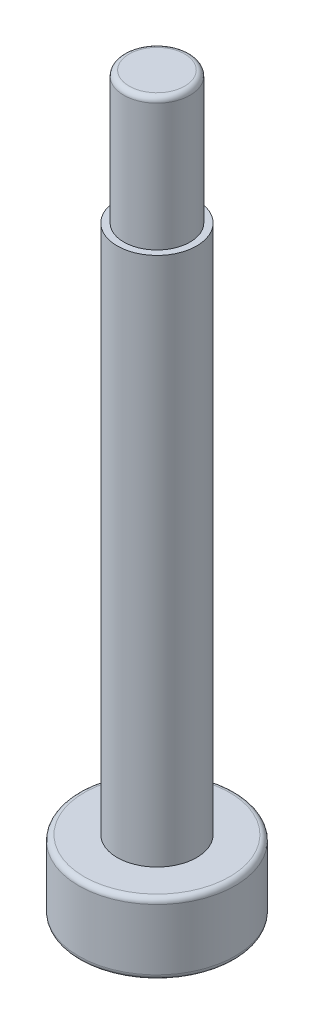
ISO-10303-21;
HEADER;
FILE_DESCRIPTION(('STEP AP214'),'2;1');
FILE_NAME('part.step','',(''),(''),'','','');
FILE_SCHEMA(('AUTOMOTIVE_DESIGN { 1 0 10303 214 1 1 1 1 }'));
ENDSEC;
DATA;
#1=APPLICATION_CONTEXT('core data for automotive mechanical design processes');
#2=APPLICATION_PROTOCOL_DEFINITION('international standard','automotive_design',2000,#1);
#3=PRODUCT_CONTEXT('',#1,'mechanical');
#4=PRODUCT('Part','Part','',(#3));
#5=PRODUCT_RELATED_PRODUCT_CATEGORY('part','',(#4));
#6=PRODUCT_DEFINITION_FORMATION('','',#4);
#7=PRODUCT_DEFINITION_CONTEXT('part definition',#1,'design');
#8=PRODUCT_DEFINITION('design','',#6,#7);
#9=PRODUCT_DEFINITION_SHAPE('','',#8);
#10=(LENGTH_UNIT() NAMED_UNIT(*) SI_UNIT(.MILLI.,.METRE.));
#11=(NAMED_UNIT(*) PLANE_ANGLE_UNIT() SI_UNIT($,.RADIAN.));
#12=(NAMED_UNIT(*) SI_UNIT($,.STERADIAN.) SOLID_ANGLE_UNIT());
#13=UNCERTAINTY_MEASURE_WITH_UNIT(LENGTH_MEASURE(1.E-05),#10,'distance_accuracy_value','');
#14=(GEOMETRIC_REPRESENTATION_CONTEXT(3) GLOBAL_UNCERTAINTY_ASSIGNED_CONTEXT((#13)) GLOBAL_UNIT_ASSIGNED_CONTEXT((#10,
#11,#12)) REPRESENTATION_CONTEXT('',''));
#15=CARTESIAN_POINT('',(0.,0.,0.));
#16=DIRECTION('',(0.,0.,1.));
#17=DIRECTION('',(1.,0.,0.));
#18=AXIS2_PLACEMENT_3D('',#15,#16,#17);
#19=CARTESIAN_POINT('',(0.,2.7,0.));
#20=DIRECTION('',(0.,-1.,0.));
#21=DIRECTION('',(0.,0.,-1.));
#22=AXIS2_PLACEMENT_3D('',#19,#20,#21);
#23=CYLINDRICAL_SURFACE('',#22,2.95);
#24=CARTESIAN_POINT('',(0.,0.2,0.));
#25=DIRECTION('',(0.,1.,0.));
#26=DIRECTION('',(0.,0.,1.));
#27=AXIS2_PLACEMENT_3D('',#24,#25,#26);
#28=CIRCLE('',#27,2.95);
#29=CARTESIAN_POINT('',(0.,0.2,2.95));
#30=VERTEX_POINT('',#29);
#31=EDGE_CURVE('E157',#30,#30,#28,.T.);
#32=ORIENTED_EDGE('',*,*,#31,.T.);
#33=EDGE_LOOP('',(#32));
#34=FACE_BOUND('',#33,.T.);
#35=CARTESIAN_POINT('',(0.,2.5,0.));
#36=DIRECTION('',(0.,1.,0.));
#37=DIRECTION('',(0.,0.,1.));
#38=AXIS2_PLACEMENT_3D('',#35,#36,#37);
#39=CIRCLE('',#38,2.95);
#40=CARTESIAN_POINT('',(0.,2.5,2.95));
#41=VERTEX_POINT('',#40);
#42=EDGE_CURVE('E149',#41,#41,#39,.F.);
#43=ORIENTED_EDGE('',*,*,#42,.T.);
#44=EDGE_LOOP('',(#43));
#45=FACE_BOUND('',#44,.T.);
#46=ADVANCED_FACE('F38',(#34,#45),#23,.T.);
#47=CARTESIAN_POINT('',(0.,2.7,0.));
#48=DIRECTION('',(0.,1.,0.));
#49=DIRECTION('',(0.,0.,1.));
#50=AXIS2_PLACEMENT_3D('',#47,#48,#49);
#51=PLANE('',#50);
#52=CARTESIAN_POINT('',(0.,2.7,0.));
#53=DIRECTION('',(0.,1.,0.));
#54=DIRECTION('',(0.,0.,1.));
#55=AXIS2_PLACEMENT_3D('',#52,#53,#54);
#56=CIRCLE('',#55,2.75);
#57=CARTESIAN_POINT('',(0.,2.7,2.75));
#58=VERTEX_POINT('',#57);
#59=EDGE_CURVE('E163',#58,#58,#56,.T.);
#60=ORIENTED_EDGE('',*,*,#59,.T.);
#61=EDGE_LOOP('',(#60));
#62=FACE_BOUND('',#61,.T.);
#63=CARTESIAN_POINT('',(0.,2.7,0.));
#64=DIRECTION('',(0.,1.,0.));
#65=DIRECTION('',(0.,0.,1.));
#66=AXIS2_PLACEMENT_3D('',#63,#64,#65);
#67=CIRCLE('',#66,1.5);
#68=CARTESIAN_POINT('',(0.,2.7,1.5));
#69=VERTEX_POINT('',#68);
#70=EDGE_CURVE('E150',#69,#69,#67,.T.);
#71=ORIENTED_EDGE('',*,*,#70,.F.);
#72=EDGE_LOOP('',(#71));
#73=FACE_BOUND('',#72,.T.);
#74=ADVANCED_FACE('F180',(#62,#73),#51,.T.);
#75=CARTESIAN_POINT('',(0.,0.,0.));
#76=DIRECTION('',(0.,1.,0.));
#77=DIRECTION('',(0.,0.,1.));
#78=AXIS2_PLACEMENT_3D('',#75,#76,#77);
#79=PLANE('',#78);
#80=CARTESIAN_POINT('',(0.,0.,0.));
#81=DIRECTION('',(0.,1.,0.));
#82=DIRECTION('',(0.,0.,1.));
#83=AXIS2_PLACEMENT_3D('',#80,#81,#82);
#84=CIRCLE('',#83,2.75);
#85=CARTESIAN_POINT('',(0.,0.,2.75));
#86=VERTEX_POINT('',#85);
#87=EDGE_CURVE('E160',#86,#86,#84,.F.);
#88=ORIENTED_EDGE('',*,*,#87,.T.);
#89=EDGE_LOOP('',(#88));
#90=FACE_BOUND('',#89,.T.);
#91=DIRECTION('',(-0.28704549437819,0.,0.95791695055322));
#92=VECTOR('',#91,1.);
#93=CARTESIAN_POINT('',(2.24728548800427,0.,-0.532016229770034));
#94=LINE('',#93,#92);
#95=CARTESIAN_POINT('',(2.24728548800427,0.,-0.532016229770034));
#96=VERTEX_POINT('',#95);
#97=CARTESIAN_POINT('',(1.58438231420861,0.,1.68019820728279));
#98=VERTEX_POINT('',#97);
#99=EDGE_CURVE('E127',#96,#98,#94,.T.);
#100=ORIENTED_EDGE('',*,*,#99,.F.);
#101=DIRECTION('',(0.686057666705715,0.,0.727547165449986));
#102=VECTOR('',#101,1.);
#103=CARTESIAN_POINT('',(0.662903173795668,0.,-2.21221443705283));
#104=LINE('',#103,#102);
#105=CARTESIAN_POINT('',(0.662903173795668,0.,-2.21221443705283));
#106=VERTEX_POINT('',#105);
#107=EDGE_CURVE('E53',#106,#96,#104,.T.);
#108=ORIENTED_EDGE('',*,*,#107,.F.);
#109=DIRECTION('',(0.973103161083906,0.,-0.230369785103234));
#110=VECTOR('',#109,1.);
#111=CARTESIAN_POINT('',(-1.58438231420861,0.,-1.68019820728279));
#112=LINE('',#111,#110);
#113=CARTESIAN_POINT('',(-1.58438231420861,0.,-1.68019820728279));
#114=VERTEX_POINT('',#113);
#115=EDGE_CURVE('E136',#114,#106,#112,.T.);
#116=ORIENTED_EDGE('',*,*,#115,.F.);
#117=DIRECTION('',(0.28704549437819,0.,-0.95791695055322));
#118=VECTOR('',#117,1.);
#119=CARTESIAN_POINT('',(-2.24728548800427,0.,0.532016229770034));
#120=LINE('',#119,#118);
#121=CARTESIAN_POINT('',(-2.24728548800427,0.,0.532016229770034));
#122=VERTEX_POINT('',#121);
#123=EDGE_CURVE('E134',#122,#114,#120,.T.);
#124=ORIENTED_EDGE('',*,*,#123,.F.);
#125=DIRECTION('',(-0.686057666705716,0.,-0.727547165449986));
#126=VECTOR('',#125,1.);
#127=CARTESIAN_POINT('',(-0.662903173795669,0.,2.21221443705283));
#128=LINE('',#127,#126);
#129=CARTESIAN_POINT('',(-0.662903173795669,0.,2.21221443705283));
#130=VERTEX_POINT('',#129);
#131=EDGE_CURVE('E101',#130,#122,#128,.T.);
#132=ORIENTED_EDGE('',*,*,#131,.F.);
#133=DIRECTION('',(-0.973103161083906,0.,0.230369785103234));
#134=VECTOR('',#133,1.);
#135=CARTESIAN_POINT('',(1.58438231420861,0.,1.68019820728279));
#136=LINE('',#135,#134);
#137=EDGE_CURVE('E130',#98,#130,#136,.T.);
#138=ORIENTED_EDGE('',*,*,#137,.F.);
#139=EDGE_LOOP('',(#100,#108,#116,#124,#132,#138));
#140=FACE_BOUND('',#139,.T.);
#141=ADVANCED_FACE('F186',(#90,#140),#79,.F.);
#142=CARTESIAN_POINT('',(0.,22.7,0.));
#143=DIRECTION('',(0.,-1.,0.));
#144=DIRECTION('',(0.,0.,-1.));
#145=AXIS2_PLACEMENT_3D('',#142,#143,#144);
#146=CYLINDRICAL_SURFACE('',#145,1.5);
#147=CARTESIAN_POINT('',(0.,22.7,0.));
#148=DIRECTION('',(0.,1.,0.));
#149=DIRECTION('',(0.,0.,1.));
#150=AXIS2_PLACEMENT_3D('',#147,#148,#149);
#151=CIRCLE('',#150,1.5);
#152=CARTESIAN_POINT('',(0.,22.7,1.5));
#153=VERTEX_POINT('',#152);
#154=EDGE_CURVE('E140',#153,#153,#151,.T.);
#155=ORIENTED_EDGE('',*,*,#154,.F.);
#156=EDGE_LOOP('',(#155));
#157=FACE_BOUND('',#156,.T.);
#158=ORIENTED_EDGE('',*,*,#70,.T.);
#159=EDGE_LOOP('',(#158));
#160=FACE_BOUND('',#159,.T.);
#161=ADVANCED_FACE('F205',(#157,#160),#146,.T.);
#162=CARTESIAN_POINT('',(0.,22.7,0.));
#163=DIRECTION('',(0.,1.,0.));
#164=DIRECTION('',(0.,0.,1.));
#165=AXIS2_PLACEMENT_3D('',#162,#163,#164);
#166=PLANE('',#165);
#167=CARTESIAN_POINT('',(0.,22.7,0.));
#168=DIRECTION('',(0.,1.,0.));
#169=DIRECTION('',(0.,0.,1.));
#170=AXIS2_PLACEMENT_3D('',#167,#168,#169);
#171=CIRCLE('',#170,1.25);
#172=CARTESIAN_POINT('',(0.,22.7,1.25));
#173=VERTEX_POINT('',#172);
#174=EDGE_CURVE('E146',#173,#173,#171,.T.);
#175=ORIENTED_EDGE('',*,*,#174,.F.);
#176=EDGE_LOOP('',(#175));
#177=FACE_BOUND('',#176,.T.);
#178=ORIENTED_EDGE('',*,*,#154,.T.);
#179=EDGE_LOOP('',(#178));
#180=FACE_BOUND('',#179,.T.);
#181=ADVANCED_FACE('F227',(#177,#180),#166,.T.);
#182=CARTESIAN_POINT('',(0.,27.7,0.));
#183=DIRECTION('',(0.,-1.,0.));
#184=DIRECTION('',(0.,0.,-1.));
#185=AXIS2_PLACEMENT_3D('',#182,#183,#184);
#186=CYLINDRICAL_SURFACE('',#185,1.25);
#187=CARTESIAN_POINT('',(0.,27.5,0.));
#188=DIRECTION('',(0.,1.,0.));
#189=DIRECTION('',(0.,0.,1.));
#190=AXIS2_PLACEMENT_3D('',#187,#188,#189);
#191=CIRCLE('',#190,1.25);
#192=CARTESIAN_POINT('',(0.,27.5,1.25));
#193=VERTEX_POINT('',#192);
#194=EDGE_CURVE('E11',#193,#193,#191,.F.);
#195=ORIENTED_EDGE('',*,*,#194,.T.);
#196=EDGE_LOOP('',(#195));
#197=FACE_BOUND('',#196,.T.);
#198=ORIENTED_EDGE('',*,*,#174,.T.);
#199=EDGE_LOOP('',(#198));
#200=FACE_BOUND('',#199,.T.);
#201=ADVANCED_FACE('F220',(#197,#200),#186,.T.);
#202=CARTESIAN_POINT('',(0.,27.7,0.));
#203=DIRECTION('',(0.,1.,0.));
#204=DIRECTION('',(0.,0.,1.));
#205=AXIS2_PLACEMENT_3D('',#202,#203,#204);
#206=PLANE('',#205);
#207=CARTESIAN_POINT('',(0.,27.7,0.));
#208=DIRECTION('',(0.,1.,0.));
#209=DIRECTION('',(0.,0.,1.));
#210=AXIS2_PLACEMENT_3D('',#207,#208,#209);
#211=CIRCLE('',#210,1.05);
#212=CARTESIAN_POINT('',(0.,27.7,1.05));
#213=VERTEX_POINT('',#212);
#214=EDGE_CURVE('E46',#213,#213,#211,.T.);
#215=ORIENTED_EDGE('',*,*,#214,.T.);
#216=EDGE_LOOP('',(#215));
#217=FACE_BOUND('',#216,.T.);
#218=ADVANCED_FACE('F168',(#217),#206,.T.);
#219=CARTESIAN_POINT('',(0.662903173795668,2.,-2.21221443705283));
#220=DIRECTION('',(0.727547165449986,0.,-0.686057666705715));
#221=DIRECTION('',(-0.686057666705716,0.,-0.727547165449986));
#222=AXIS2_PLACEMENT_3D('',#219,#220,#221);
#223=PLANE('',#222);
#224=ORIENTED_EDGE('',*,*,#107,.T.);
#225=DIRECTION('',(0.,-1.,0.));
#226=VECTOR('',#225,1.);
#227=CARTESIAN_POINT('',(2.24728548800427,2.,-0.532016229770034));
#228=LINE('',#227,#226);
#229=CARTESIAN_POINT('',(2.24728548800427,2.,-0.532016229770034));
#230=VERTEX_POINT('',#229);
#231=EDGE_CURVE('E83',#230,#96,#228,.T.);
#232=ORIENTED_EDGE('',*,*,#231,.F.);
#233=DIRECTION('',(0.686057666705715,0.,0.727547165449986));
#234=VECTOR('',#233,1.);
#235=CARTESIAN_POINT('',(0.662903173795668,2.,-2.21221443705283));
#236=LINE('',#235,#234);
#237=CARTESIAN_POINT('',(0.662903173795668,2.,-2.21221443705283));
#238=VERTEX_POINT('',#237);
#239=EDGE_CURVE('E138',#238,#230,#236,.T.);
#240=ORIENTED_EDGE('',*,*,#239,.F.);
#241=DIRECTION('',(0.,-1.,0.));
#242=VECTOR('',#241,1.);
#243=CARTESIAN_POINT('',(0.662903173795668,2.,-2.21221443705283));
#244=LINE('',#243,#242);
#245=EDGE_CURVE('E61',#238,#106,#244,.T.);
#246=ORIENTED_EDGE('',*,*,#245,.T.);
#247=EDGE_LOOP('',(#224,#232,#240,#246));
#248=FACE_BOUND('',#247,.T.);
#249=ADVANCED_FACE('F211',(#248),#223,.F.);
#250=CARTESIAN_POINT('',(-1.58438231420861,2.,-1.68019820728279));
#251=DIRECTION('',(-0.230369785103234,0.,-0.973103161083906));
#252=DIRECTION('',(-0.973103161083906,0.,0.230369785103234));
#253=AXIS2_PLACEMENT_3D('',#250,#251,#252);
#254=PLANE('',#253);
#255=ORIENTED_EDGE('',*,*,#115,.T.);
#256=ORIENTED_EDGE('',*,*,#245,.F.);
#257=DIRECTION('',(0.973103161083906,0.,-0.230369785103234));
#258=VECTOR('',#257,1.);
#259=CARTESIAN_POINT('',(-1.58438231420861,2.,-1.68019820728279));
#260=LINE('',#259,#258);
#261=CARTESIAN_POINT('',(-1.58438231420861,2.,-1.68019820728279));
#262=VERTEX_POINT('',#261);
#263=EDGE_CURVE('E113',#262,#238,#260,.T.);
#264=ORIENTED_EDGE('',*,*,#263,.F.);
#265=DIRECTION('',(0.,-1.,0.));
#266=VECTOR('',#265,1.);
#267=CARTESIAN_POINT('',(-1.58438231420861,2.,-1.68019820728279));
#268=LINE('',#267,#266);
#269=EDGE_CURVE('E105',#262,#114,#268,.T.);
#270=ORIENTED_EDGE('',*,*,#269,.T.);
#271=EDGE_LOOP('',(#255,#256,#264,#270));
#272=FACE_BOUND('',#271,.T.);
#273=ADVANCED_FACE('F213',(#272),#254,.F.);
#274=CARTESIAN_POINT('',(-2.24728548800427,2.,0.532016229770034));
#275=DIRECTION('',(-0.95791695055322,0.,-0.28704549437819));
#276=DIRECTION('',(-0.28704549437819,0.,0.95791695055322));
#277=AXIS2_PLACEMENT_3D('',#274,#275,#276);
#278=PLANE('',#277);
#279=ORIENTED_EDGE('',*,*,#123,.T.);
#280=ORIENTED_EDGE('',*,*,#269,.F.);
#281=DIRECTION('',(0.28704549437819,0.,-0.95791695055322));
#282=VECTOR('',#281,1.);
#283=CARTESIAN_POINT('',(-2.24728548800427,2.,0.532016229770034));
#284=LINE('',#283,#282);
#285=CARTESIAN_POINT('',(-2.24728548800427,2.,0.532016229770034));
#286=VERTEX_POINT('',#285);
#287=EDGE_CURVE('E109',#286,#262,#284,.T.);
#288=ORIENTED_EDGE('',*,*,#287,.F.);
#289=DIRECTION('',(0.,-1.,0.));
#290=VECTOR('',#289,1.);
#291=CARTESIAN_POINT('',(-2.24728548800427,2.,0.532016229770034));
#292=LINE('',#291,#290);
#293=EDGE_CURVE('E94',#286,#122,#292,.T.);
#294=ORIENTED_EDGE('',*,*,#293,.T.);
#295=EDGE_LOOP('',(#279,#280,#288,#294));
#296=FACE_BOUND('',#295,.T.);
#297=ADVANCED_FACE('F110',(#296),#278,.F.);
#298=CARTESIAN_POINT('',(-0.662903173795669,2.,2.21221443705283));
#299=DIRECTION('',(-0.727547165449986,0.,0.686057666705716));
#300=DIRECTION('',(0.686057666705716,0.,0.727547165449986));
#301=AXIS2_PLACEMENT_3D('',#298,#299,#300);
#302=PLANE('',#301);
#303=ORIENTED_EDGE('',*,*,#131,.T.);
#304=ORIENTED_EDGE('',*,*,#293,.F.);
#305=DIRECTION('',(-0.686057666705716,0.,-0.727547165449986));
#306=VECTOR('',#305,1.);
#307=CARTESIAN_POINT('',(-0.662903173795669,2.,2.21221443705283));
#308=LINE('',#307,#306);
#309=CARTESIAN_POINT('',(-0.662903173795669,2.,2.21221443705283));
#310=VERTEX_POINT('',#309);
#311=EDGE_CURVE('E98',#310,#286,#308,.T.);
#312=ORIENTED_EDGE('',*,*,#311,.F.);
#313=DIRECTION('',(0.,-1.,0.));
#314=VECTOR('',#313,1.);
#315=CARTESIAN_POINT('',(-0.662903173795669,2.,2.21221443705283));
#316=LINE('',#315,#314);
#317=EDGE_CURVE('E106',#310,#130,#316,.T.);
#318=ORIENTED_EDGE('',*,*,#317,.T.);
#319=EDGE_LOOP('',(#303,#304,#312,#318));
#320=FACE_BOUND('',#319,.T.);
#321=ADVANCED_FACE('F96',(#320),#302,.F.);
#322=CARTESIAN_POINT('',(1.58438231420861,2.,1.68019820728279));
#323=DIRECTION('',(0.230369785103234,0.,0.973103161083906));
#324=DIRECTION('',(0.973103161083906,0.,-0.230369785103234));
#325=AXIS2_PLACEMENT_3D('',#322,#323,#324);
#326=PLANE('',#325);
#327=ORIENTED_EDGE('',*,*,#137,.T.);
#328=ORIENTED_EDGE('',*,*,#317,.F.);
#329=DIRECTION('',(-0.973103161083906,0.,0.230369785103234));
#330=VECTOR('',#329,1.);
#331=CARTESIAN_POINT('',(1.58438231420861,2.,1.68019820728279));
#332=LINE('',#331,#330);
#333=CARTESIAN_POINT('',(1.58438231420861,2.,1.68019820728279));
#334=VERTEX_POINT('',#333);
#335=EDGE_CURVE('E119',#334,#310,#332,.T.);
#336=ORIENTED_EDGE('',*,*,#335,.F.);
#337=DIRECTION('',(0.,-1.,0.));
#338=VECTOR('',#337,1.);
#339=CARTESIAN_POINT('',(1.58438231420861,2.,1.68019820728279));
#340=LINE('',#339,#338);
#341=EDGE_CURVE('E143',#334,#98,#340,.T.);
#342=ORIENTED_EDGE('',*,*,#341,.T.);
#343=EDGE_LOOP('',(#327,#328,#336,#342));
#344=FACE_BOUND('',#343,.T.);
#345=ADVANCED_FACE('F285',(#344),#326,.F.);
#346=CARTESIAN_POINT('',(2.24728548800427,2.,-0.532016229770034));
#347=DIRECTION('',(0.95791695055322,0.,0.28704549437819));
#348=DIRECTION('',(0.28704549437819,0.,-0.95791695055322));
#349=AXIS2_PLACEMENT_3D('',#346,#347,#348);
#350=PLANE('',#349);
#351=ORIENTED_EDGE('',*,*,#99,.T.);
#352=ORIENTED_EDGE('',*,*,#341,.F.);
#353=DIRECTION('',(-0.28704549437819,0.,0.95791695055322));
#354=VECTOR('',#353,1.);
#355=CARTESIAN_POINT('',(2.24728548800427,2.,-0.532016229770034));
#356=LINE('',#355,#354);
#357=EDGE_CURVE('E121',#230,#334,#356,.T.);
#358=ORIENTED_EDGE('',*,*,#357,.F.);
#359=ORIENTED_EDGE('',*,*,#231,.T.);
#360=EDGE_LOOP('',(#351,#352,#358,#359));
#361=FACE_BOUND('',#360,.T.);
#362=ADVANCED_FACE('F197',(#361),#350,.F.);
#363=CARTESIAN_POINT('',(0.,2.,0.));
#364=DIRECTION('',(0.,-1.,0.));
#365=DIRECTION('',(0.,0.,-1.));
#366=AXIS2_PLACEMENT_3D('',#363,#364,#365);
#367=PLANE('',#366);
#368=ORIENTED_EDGE('',*,*,#239,.T.);
#369=ORIENTED_EDGE('',*,*,#357,.T.);
#370=ORIENTED_EDGE('',*,*,#335,.T.);
#371=ORIENTED_EDGE('',*,*,#311,.T.);
#372=ORIENTED_EDGE('',*,*,#287,.T.);
#373=ORIENTED_EDGE('',*,*,#263,.T.);
#374=EDGE_LOOP('',(#368,#369,#370,#371,#372,#373));
#375=FACE_BOUND('',#374,.T.);
#376=ADVANCED_FACE('F116',(#375),#367,.T.);
#377=CARTESIAN_POINT('',(0.,0.2,0.));
#378=DIRECTION('',(0.,1.,0.));
#379=DIRECTION('',(0.,0.,1.));
#380=AXIS2_PLACEMENT_3D('',#377,#378,#379);
#381=TOROIDAL_SURFACE('',#380,2.75,0.2);
#382=ORIENTED_EDGE('',*,*,#87,.F.);
#383=EDGE_LOOP('',(#382));
#384=FACE_BOUND('',#383,.T.);
#385=ORIENTED_EDGE('',*,*,#31,.F.);
#386=EDGE_LOOP('',(#385));
#387=FACE_BOUND('',#386,.T.);
#388=ADVANCED_FACE('F176',(#384,#387),#381,.T.);
#389=CARTESIAN_POINT('',(0.,2.5,0.));
#390=DIRECTION('',(0.,1.,0.));
#391=DIRECTION('',(0.,0.,1.));
#392=AXIS2_PLACEMENT_3D('',#389,#390,#391);
#393=TOROIDAL_SURFACE('',#392,2.75,0.2);
#394=ORIENTED_EDGE('',*,*,#42,.F.);
#395=EDGE_LOOP('',(#394));
#396=FACE_BOUND('',#395,.T.);
#397=ORIENTED_EDGE('',*,*,#59,.F.);
#398=EDGE_LOOP('',(#397));
#399=FACE_BOUND('',#398,.T.);
#400=ADVANCED_FACE('F171',(#396,#399),#393,.T.);
#401=CARTESIAN_POINT('',(0.,27.5,0.));
#402=DIRECTION('',(0.,1.,0.));
#403=DIRECTION('',(0.,0.,1.));
#404=AXIS2_PLACEMENT_3D('',#401,#402,#403);
#405=TOROIDAL_SURFACE('',#404,1.05,0.2);
#406=ORIENTED_EDGE('',*,*,#194,.F.);
#407=EDGE_LOOP('',(#406));
#408=FACE_BOUND('',#407,.T.);
#409=ORIENTED_EDGE('',*,*,#214,.F.);
#410=EDGE_LOOP('',(#409));
#411=FACE_BOUND('',#410,.T.);
#412=ADVANCED_FACE('F40',(#408,#411),#405,.T.);
#413=CLOSED_SHELL('',(#46,#74,#141,#161,#181,#201,#218,#249,#273,#297,#321,#345,#362,#376,#388,
#400,#412));
#414=MANIFOLD_SOLID_BREP('B2',#413);
#415=ADVANCED_BREP_SHAPE_REPRESENTATION('',(#18,#414),#14);
#416=SHAPE_DEFINITION_REPRESENTATION(#9,#415);
ENDSEC;
END-ISO-10303-21;
